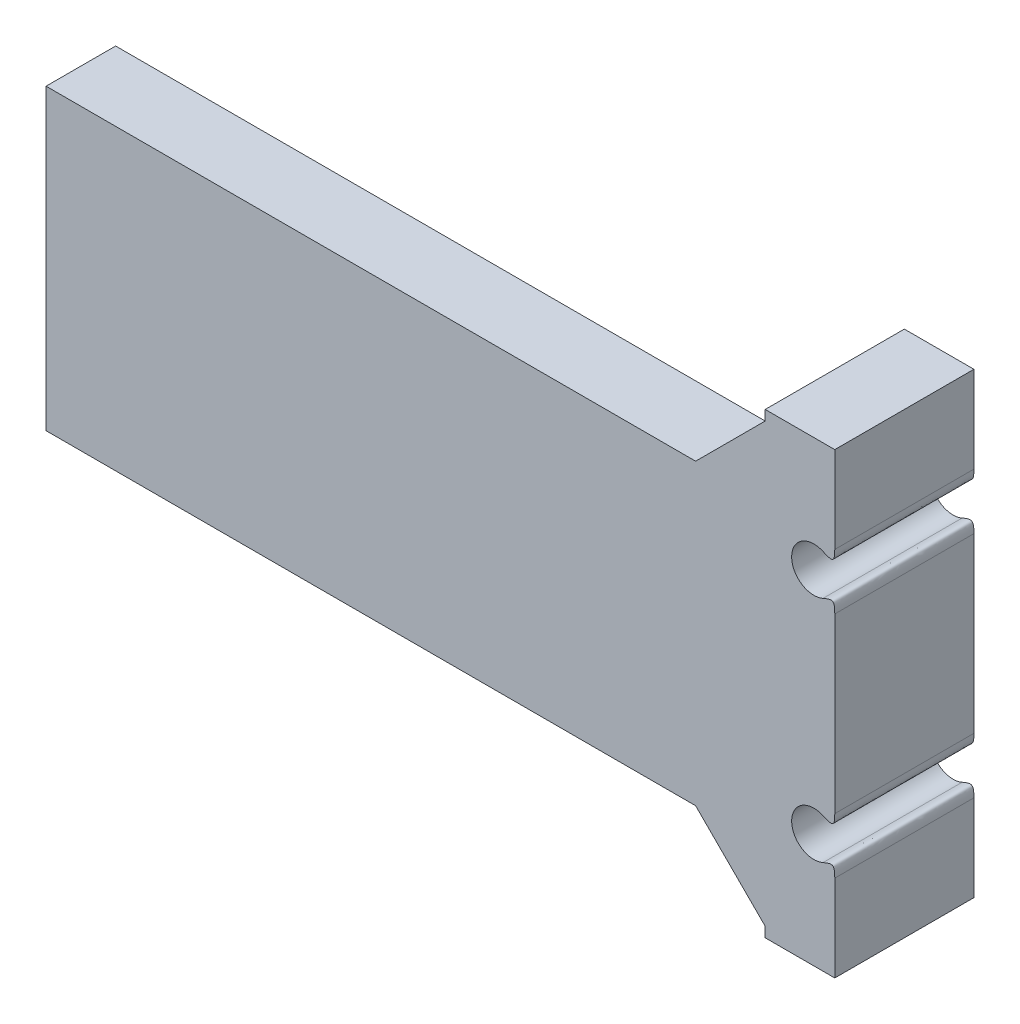
ISO-10303-21;
HEADER;
FILE_DESCRIPTION(('STEP AP214'),'2;1');
FILE_NAME('part.step','',(''),(''),'','','');
FILE_SCHEMA(('AUTOMOTIVE_DESIGN { 1 0 10303 214 1 1 1 1 }'));
ENDSEC;
DATA;
#1=APPLICATION_CONTEXT('core data for automotive mechanical design processes');
#2=APPLICATION_PROTOCOL_DEFINITION('international standard','automotive_design',2000,#1);
#3=PRODUCT_CONTEXT('',#1,'mechanical');
#4=PRODUCT('Part','Part','',(#3));
#5=PRODUCT_RELATED_PRODUCT_CATEGORY('part','',(#4));
#6=PRODUCT_DEFINITION_FORMATION('','',#4);
#7=PRODUCT_DEFINITION_CONTEXT('part definition',#1,'design');
#8=PRODUCT_DEFINITION('design','',#6,#7);
#9=PRODUCT_DEFINITION_SHAPE('','',#8);
#10=(LENGTH_UNIT() NAMED_UNIT(*) SI_UNIT(.MILLI.,.METRE.));
#11=(NAMED_UNIT(*) PLANE_ANGLE_UNIT() SI_UNIT($,.RADIAN.));
#12=(NAMED_UNIT(*) SI_UNIT($,.STERADIAN.) SOLID_ANGLE_UNIT());
#13=UNCERTAINTY_MEASURE_WITH_UNIT(LENGTH_MEASURE(1.E-05),#10,'distance_accuracy_value','');
#14=(GEOMETRIC_REPRESENTATION_CONTEXT(3) GLOBAL_UNCERTAINTY_ASSIGNED_CONTEXT((#13)) GLOBAL_UNIT_ASSIGNED_CONTEXT((#10,
#11,#12)) REPRESENTATION_CONTEXT('',''));
#15=CARTESIAN_POINT('',(0.,0.,0.));
#16=DIRECTION('',(0.,0.,1.));
#17=DIRECTION('',(1.,0.,0.));
#18=AXIS2_PLACEMENT_3D('',#15,#16,#17);
#19=CARTESIAN_POINT('',(-61.6780461379733,-1.56358606007839,-10.));
#20=DIRECTION('',(0.,-1.,0.));
#21=DIRECTION('',(1.,0.,0.));
#22=AXIS2_PLACEMENT_3D('',#19,#20,#21);
#23=PLANE('',#22);
#24=DIRECTION('',(0.,0.,1.));
#25=VECTOR('',#24,1.);
#26=CARTESIAN_POINT('',(-61.6780461379733,-1.56358606007839,-10.));
#27=LINE('',#26,#25);
#28=CARTESIAN_POINT('',(-61.6780461379733,-1.56358606007839,-5.));
#29=VERTEX_POINT('',#28);
#30=CARTESIAN_POINT('',(-61.6780461379733,-1.56358606007839,0.));
#31=VERTEX_POINT('',#30);
#32=EDGE_CURVE('E503',#29,#31,#27,.T.);
#33=ORIENTED_EDGE('',*,*,#32,.F.);
#34=DIRECTION('',(1.,0.,0.));
#35=VECTOR('',#34,1.);
#36=CARTESIAN_POINT('',(-61.6780461379733,-1.56358606007839,-5.));
#37=LINE('',#36,#35);
#38=CARTESIAN_POINT('',(-14.9999999999994,-1.56358606007837,-5.));
#39=VERTEX_POINT('',#38);
#40=EDGE_CURVE('E317',#29,#39,#37,.T.);
#41=ORIENTED_EDGE('',*,*,#40,.T.);
#42=DIRECTION('',(0.,0.,1.));
#43=VECTOR('',#42,1.);
#44=CARTESIAN_POINT('',(-14.9999999999994,-1.56358606007839,0.));
#45=LINE('',#44,#43);
#46=CARTESIAN_POINT('',(-14.9999999999994,-1.56358606007839,0.));
#47=VERTEX_POINT('',#46);
#48=EDGE_CURVE('E221',#39,#47,#45,.T.);
#49=ORIENTED_EDGE('',*,*,#48,.T.);
#50=DIRECTION('',(1.,0.,0.));
#51=VECTOR('',#50,1.);
#52=CARTESIAN_POINT('',(-61.6780461379733,-1.56358606007839,0.));
#53=LINE('',#52,#51);
#54=EDGE_CURVE('E323',#31,#47,#53,.T.);
#55=ORIENTED_EDGE('',*,*,#54,.F.);
#56=EDGE_LOOP('',(#33,#41,#49,#55));
#57=FACE_BOUND('',#56,.T.);
#58=ADVANCED_FACE('F46',(#57),#23,.T.);
#59=CARTESIAN_POINT('',(-61.6780461379733,19.8788046466407,-10.));
#60=DIRECTION('',(-1.,0.,0.));
#61=DIRECTION('',(0.,0.,1.));
#62=AXIS2_PLACEMENT_3D('',#59,#60,#61);
#63=PLANE('',#62);
#64=DIRECTION('',(0.,0.,1.));
#65=VECTOR('',#64,1.);
#66=CARTESIAN_POINT('',(-61.6780461379733,19.8788046466407,-10.));
#67=LINE('',#66,#65);
#68=CARTESIAN_POINT('',(-61.6780461379733,19.8788046466407,-5.));
#69=VERTEX_POINT('',#68);
#70=CARTESIAN_POINT('',(-61.6780461379733,19.8788046466407,0.));
#71=VERTEX_POINT('',#70);
#72=EDGE_CURVE('E313',#69,#71,#67,.T.);
#73=ORIENTED_EDGE('',*,*,#72,.F.);
#74=DIRECTION('',(0.,-1.,0.));
#75=VECTOR('',#74,1.);
#76=CARTESIAN_POINT('',(-61.6780461379733,30.7152185865621,-5.));
#77=LINE('',#76,#75);
#78=EDGE_CURVE('E629',#69,#29,#77,.T.);
#79=ORIENTED_EDGE('',*,*,#78,.T.);
#80=ORIENTED_EDGE('',*,*,#32,.T.);
#81=DIRECTION('',(0.,-1.,0.));
#82=VECTOR('',#81,1.);
#83=CARTESIAN_POINT('',(-61.6780461379733,19.8788046466407,0.));
#84=LINE('',#83,#82);
#85=EDGE_CURVE('E320',#71,#31,#84,.T.);
#86=ORIENTED_EDGE('',*,*,#85,.F.);
#87=EDGE_LOOP('',(#73,#79,#80,#86));
#88=FACE_BOUND('',#87,.T.);
#89=ADVANCED_FACE('F641',(#88),#63,.T.);
#90=CARTESIAN_POINT('',(-9.99999999999941,19.8788046466407,-10.));
#91=DIRECTION('',(0.,1.,0.));
#92=DIRECTION('',(0.,0.,1.));
#93=AXIS2_PLACEMENT_3D('',#90,#91,#92);
#94=PLANE('',#93);
#95=DIRECTION('',(0.,0.,-1.));
#96=VECTOR('',#95,1.);
#97=CARTESIAN_POINT('',(-14.9999999999994,19.8788046466407,-10.));
#98=LINE('',#97,#96);
#99=CARTESIAN_POINT('',(-14.9999999999994,19.8788046466407,0.));
#100=VERTEX_POINT('',#99);
#101=CARTESIAN_POINT('',(-14.9999999999994,19.8788046466407,-5.00000000000006));
#102=VERTEX_POINT('',#101);
#103=EDGE_CURVE('E215',#100,#102,#98,.T.);
#104=ORIENTED_EDGE('',*,*,#103,.T.);
#105=DIRECTION('',(-1.,0.,0.));
#106=VECTOR('',#105,1.);
#107=CARTESIAN_POINT('',(-9.99999999999941,19.8788046466407,-5.));
#108=LINE('',#107,#106);
#109=EDGE_CURVE('E191',#102,#69,#108,.T.);
#110=ORIENTED_EDGE('',*,*,#109,.T.);
#111=ORIENTED_EDGE('',*,*,#72,.T.);
#112=DIRECTION('',(-1.,0.,0.));
#113=VECTOR('',#112,1.);
#114=CARTESIAN_POINT('',(-9.99999999999941,19.8788046466407,0.));
#115=LINE('',#114,#113);
#116=EDGE_CURVE('E316',#100,#71,#115,.T.);
#117=ORIENTED_EDGE('',*,*,#116,.F.);
#118=EDGE_LOOP('',(#104,#110,#111,#117));
#119=FACE_BOUND('',#118,.T.);
#120=ADVANCED_FACE('F643',(#119),#94,.T.);
#121=CARTESIAN_POINT('',(-6.49999999999951,17.3788046466405,-10.));
#122=DIRECTION('',(0.,0.,1.));
#123=DIRECTION('',(1.,0.,0.));
#124=AXIS2_PLACEMENT_3D('',#121,#122,#123);
#125=PLANE('',#124);
#126=DIRECTION('',(0.,1.,0.));
#127=VECTOR('',#126,1.);
#128=CARTESIAN_POINT('',(-4.99999999999952,25.6000000000002,-10.));
#129=LINE('',#128,#127);
#130=CARTESIAN_POINT('',(-4.9999999999995,19.3862906366289,-10.));
#131=VERTEX_POINT('',#130);
#132=CARTESIAN_POINT('',(-4.99999999999952,25.6000000000002,-10.));
#133=VERTEX_POINT('',#132);
#134=EDGE_CURVE('E298',#131,#133,#129,.T.);
#135=ORIENTED_EDGE('',*,*,#134,.F.);
#136=CARTESIAN_POINT('',(-5.84545454545405,18.8387944575412,-10.));
#137=CARTESIAN_POINT('',(-4.9999999999995,18.4597586412496,-10.));
#138=CARTESIAN_POINT('',(-4.9999999999995,19.3862906366289,-10.));
#139=(BOUNDED_CURVE() B_SPLINE_CURVE(2,(#136,#137,#138),.UNSPECIFIED.,.F.,
.F.) B_SPLINE_CURVE_WITH_KNOTS((3,3),(0.,1.),
.UNSPECIFIED.) CURVE() GEOMETRIC_REPRESENTATION_ITEM() RATIONAL_B_SPLINE_CURVE((1.,
1.85714285714286,1.)) REPRESENTATION_ITEM(''));
#140=CARTESIAN_POINT('',(-5.84545454545405,18.8387944575412,-10.));
#141=VERTEX_POINT('',#140);
#142=EDGE_CURVE('E360',#131,#141,#139,.F.);
#143=ORIENTED_EDGE('',*,*,#142,.T.);
#144=CARTESIAN_POINT('',(-6.49999999999951,17.3788046466405,-10.));
#145=DIRECTION('',(0.,0.,-1.));
#146=DIRECTION('',(1.,0.,0.));
#147=AXIS2_PLACEMENT_3D('',#144,#145,#146);
#148=CIRCLE('',#147,1.6);
#149=CARTESIAN_POINT('',(-5.84545454545404,15.9188148357398,-10.));
#150=VERTEX_POINT('',#149);
#151=EDGE_CURVE('E236',#150,#141,#148,.T.);
#152=ORIENTED_EDGE('',*,*,#151,.F.);
#153=CARTESIAN_POINT('',(-4.99999999999949,15.371318656652,-10.));
#154=CARTESIAN_POINT('',(-4.99999999999949,16.2978506520313,-10.));
#155=CARTESIAN_POINT('',(-5.84545454545404,15.9188148357398,-10.));
#156=(BOUNDED_CURVE() B_SPLINE_CURVE(2,(#153,#154,#155),.UNSPECIFIED.,.F.,
.F.) B_SPLINE_CURVE_WITH_KNOTS((3,3),(0.,1.),
.UNSPECIFIED.) CURVE() GEOMETRIC_REPRESENTATION_ITEM() RATIONAL_B_SPLINE_CURVE((1.,
1.85714285714286,1.)) REPRESENTATION_ITEM(''));
#157=CARTESIAN_POINT('',(-4.99999999999949,15.371318656652,-10.));
#158=VERTEX_POINT('',#157);
#159=EDGE_CURVE('E440',#150,#158,#156,.F.);
#160=ORIENTED_EDGE('',*,*,#159,.T.);
#161=DIRECTION('',(0.,1.,0.));
#162=VECTOR('',#161,1.);
#163=CARTESIAN_POINT('',(-4.99999999999949,16.8220282103575,-10.));
#164=LINE('',#163,#162);
#165=CARTESIAN_POINT('',(-4.99999999999944,2.94389992990988,-10.));
#166=VERTEX_POINT('',#165);
#167=EDGE_CURVE('E460',#166,#158,#164,.T.);
#168=ORIENTED_EDGE('',*,*,#167,.F.);
#169=CARTESIAN_POINT('',(-5.84545454545399,2.39640375082211,-10.));
#170=CARTESIAN_POINT('',(-4.99999999999944,2.01736793453057,-10.));
#171=CARTESIAN_POINT('',(-4.99999999999945,2.94389992990988,-10.));
#172=(BOUNDED_CURVE() B_SPLINE_CURVE(2,(#169,#170,#171),.UNSPECIFIED.,.F.,
.F.) B_SPLINE_CURVE_WITH_KNOTS((3,3),(0.,1.),
.UNSPECIFIED.) CURVE() GEOMETRIC_REPRESENTATION_ITEM() RATIONAL_B_SPLINE_CURVE((1.,
1.85714285714286,1.)) REPRESENTATION_ITEM(''));
#173=CARTESIAN_POINT('',(-5.84545454545399,2.39640375082211,-10.));
#174=VERTEX_POINT('',#173);
#175=EDGE_CURVE('E74',#166,#174,#172,.F.);
#176=ORIENTED_EDGE('',*,*,#175,.T.);
#177=CARTESIAN_POINT('',(-6.49999999999945,0.936413939921402,-10.));
#178=DIRECTION('',(0.,0.,-1.));
#179=DIRECTION('',(1.,0.,0.));
#180=AXIS2_PLACEMENT_3D('',#177,#178,#179);
#181=CIRCLE('',#180,1.6);
#182=CARTESIAN_POINT('',(-5.84545454545398,-0.523575870979301,-10.));
#183=VERTEX_POINT('',#182);
#184=EDGE_CURVE('E614',#183,#174,#181,.T.);
#185=ORIENTED_EDGE('',*,*,#184,.F.);
#186=CARTESIAN_POINT('',(-4.99999999999943,-1.07107205006706,-10.));
#187=CARTESIAN_POINT('',(-4.99999999999943,-0.144540054687758,-10.));
#188=CARTESIAN_POINT('',(-5.84545454545398,-0.523575870979301,-10.));
#189=(BOUNDED_CURVE() B_SPLINE_CURVE(2,(#186,#187,#188),.UNSPECIFIED.,.F.,
.F.) B_SPLINE_CURVE_WITH_KNOTS((3,3),(0.,1.),
.UNSPECIFIED.) CURVE() GEOMETRIC_REPRESENTATION_ITEM() RATIONAL_B_SPLINE_CURVE((1.,
1.85714285714286,1.)) REPRESENTATION_ITEM(''));
#190=CARTESIAN_POINT('',(-4.99999999999943,-1.07107205006706,-10.));
#191=VERTEX_POINT('',#190);
#192=EDGE_CURVE('E67',#183,#191,#189,.F.);
#193=ORIENTED_EDGE('',*,*,#192,.T.);
#194=DIRECTION('',(0.,1.,0.));
#195=VECTOR('',#194,1.);
#196=CARTESIAN_POINT('',(-4.99999999999944,0.379637503638441,-10.));
#197=LINE('',#196,#195);
#198=CARTESIAN_POINT('',(-4.99999999999941,-7.28478141343791,-10.));
#199=VERTEX_POINT('',#198);
#200=EDGE_CURVE('E486',#199,#191,#197,.T.);
#201=ORIENTED_EDGE('',*,*,#200,.F.);
#202=DIRECTION('',(1.,0.,0.));
#203=VECTOR('',#202,1.);
#204=CARTESIAN_POINT('',(-4.99999999999941,-7.28478141343791,-10.));
#205=LINE('',#204,#203);
#206=CARTESIAN_POINT('',(-9.99999999999941,-7.28478141343791,-10.));
#207=VERTEX_POINT('',#206);
#208=EDGE_CURVE('E498',#207,#199,#205,.T.);
#209=ORIENTED_EDGE('',*,*,#208,.F.);
#210=DIRECTION('',(0.,-1.,0.));
#211=VECTOR('',#210,1.);
#212=CARTESIAN_POINT('',(-9.99999999999941,-7.28478141343791,-10.));
#213=LINE('',#212,#211);
#214=CARTESIAN_POINT('',(-9.99999999999941,-6.56358606007836,-10.));
#215=VERTEX_POINT('',#214);
#216=EDGE_CURVE('E203',#215,#207,#213,.T.);
#217=ORIENTED_EDGE('',*,*,#216,.F.);
#218=DIRECTION('',(0.,-1.,0.));
#219=VECTOR('',#218,1.);
#220=CARTESIAN_POINT('',(-9.99999999999942,30.7152185865621,-10.));
#221=LINE('',#220,#219);
#222=CARTESIAN_POINT('',(-9.99999999999941,24.8788046466407,-10.));
#223=VERTEX_POINT('',#222);
#224=EDGE_CURVE('E182',#223,#215,#221,.T.);
#225=ORIENTED_EDGE('',*,*,#224,.F.);
#226=DIRECTION('',(0.,-1.,0.));
#227=VECTOR('',#226,1.);
#228=CARTESIAN_POINT('',(-9.99999999999941,19.8788046466407,-10.));
#229=LINE('',#228,#227);
#230=CARTESIAN_POINT('',(-9.99999999999941,25.6000000000002,-10.));
#231=VERTEX_POINT('',#230);
#232=EDGE_CURVE('E200',#231,#223,#229,.T.);
#233=ORIENTED_EDGE('',*,*,#232,.F.);
#234=DIRECTION('',(-1.,0.,0.));
#235=VECTOR('',#234,1.);
#236=CARTESIAN_POINT('',(-9.99999999999941,25.6000000000002,-10.));
#237=LINE('',#236,#235);
#238=EDGE_CURVE('E306',#133,#231,#237,.T.);
#239=ORIENTED_EDGE('',*,*,#238,.F.);
#240=EDGE_LOOP('',(#135,#143,#152,#160,#168,#176,#185,#193,#201,#209,#217,#225,#233,#239));
#241=FACE_BOUND('',#240,.T.);
#242=ADVANCED_FACE('F198',(#241),#125,.F.);
#243=CARTESIAN_POINT('',(-14.9999999999994,-1.56358606007839,-10.));
#244=DIRECTION('',(-0.707106781186544,-0.707106781186551,0.));
#245=DIRECTION('',(0.,0.,-1.));
#246=AXIS2_PLACEMENT_3D('',#243,#244,#245);
#247=PLANE('',#246);
#248=DIRECTION('',(0.577350269189629,-0.577350269189623,-0.577350269189626));
#249=VECTOR('',#248,1.);
#250=CARTESIAN_POINT('',(-13.3333333333328,-3.23025272674505,-6.66666666666667));
#251=LINE('',#250,#249);
#252=EDGE_CURVE('E627',#215,#39,#251,.F.);
#253=ORIENTED_EDGE('',*,*,#252,.F.);
#254=DIRECTION('',(0.,0.,-1.));
#255=VECTOR('',#254,1.);
#256=CARTESIAN_POINT('',(-9.99999999999941,-6.56358606007837,-10.));
#257=LINE('',#256,#255);
#258=CARTESIAN_POINT('',(-9.99999999999941,-6.56358606007837,0.));
#259=VERTEX_POINT('',#258);
#260=EDGE_CURVE('E216',#259,#215,#257,.T.);
#261=ORIENTED_EDGE('',*,*,#260,.F.);
#262=DIRECTION('',(-0.707106781186551,0.707106781186544,0.));
#263=VECTOR('',#262,1.);
#264=CARTESIAN_POINT('',(-14.9999999999994,-1.56358606007839,0.));
#265=LINE('',#264,#263);
#266=EDGE_CURVE('E218',#47,#259,#265,.F.);
#267=ORIENTED_EDGE('',*,*,#266,.F.);
#268=ORIENTED_EDGE('',*,*,#48,.F.);
#269=EDGE_LOOP('',(#253,#261,#267,#268));
#270=FACE_BOUND('',#269,.T.);
#271=ADVANCED_FACE('F635',(#270),#247,.T.);
#272=CARTESIAN_POINT('',(-9.99999999999941,24.8788046466408,-10.));
#273=DIRECTION('',(-0.707106781186551,0.707106781186544,0.));
#274=DIRECTION('',(0.,0.,-1.));
#275=AXIS2_PLACEMENT_3D('',#272,#273,#274);
#276=PLANE('',#275);
#277=DIRECTION('',(-0.577350269189625,-0.577350269189631,0.577350269189622));
#278=VECTOR('',#277,1.);
#279=CARTESIAN_POINT('',(-9.99999999999941,24.8788046466407,-10.));
#280=LINE('',#279,#278);
#281=EDGE_CURVE('E179',#102,#223,#280,.F.);
#282=ORIENTED_EDGE('',*,*,#281,.F.);
#283=ORIENTED_EDGE('',*,*,#103,.F.);
#284=DIRECTION('',(0.707106781186544,0.707106781186551,0.));
#285=VECTOR('',#284,1.);
#286=CARTESIAN_POINT('',(-9.99999999999941,24.8788046466408,0.));
#287=LINE('',#286,#285);
#288=CARTESIAN_POINT('',(-9.99999999999941,24.8788046466408,0.));
#289=VERTEX_POINT('',#288);
#290=EDGE_CURVE('E192',#289,#100,#287,.F.);
#291=ORIENTED_EDGE('',*,*,#290,.F.);
#292=DIRECTION('',(0.,0.,1.));
#293=VECTOR('',#292,1.);
#294=CARTESIAN_POINT('',(-9.99999999999941,24.8788046466408,0.));
#295=LINE('',#294,#293);
#296=EDGE_CURVE('E209',#223,#289,#295,.T.);
#297=ORIENTED_EDGE('',*,*,#296,.F.);
#298=EDGE_LOOP('',(#282,#283,#291,#297));
#299=FACE_BOUND('',#298,.T.);
#300=ADVANCED_FACE('F214',(#299),#276,.T.);
#301=CARTESIAN_POINT('',(-9.99999999999941,19.8788046466407,-10.));
#302=DIRECTION('',(-1.,0.,0.));
#303=DIRECTION('',(0.,0.,1.));
#304=AXIS2_PLACEMENT_3D('',#301,#302,#303);
#305=PLANE('',#304);
#306=ORIENTED_EDGE('',*,*,#232,.T.);
#307=ORIENTED_EDGE('',*,*,#296,.T.);
#308=DIRECTION('',(0.,-1.,0.));
#309=VECTOR('',#308,1.);
#310=CARTESIAN_POINT('',(-9.99999999999941,19.8788046466407,0.));
#311=LINE('',#310,#309);
#312=CARTESIAN_POINT('',(-9.99999999999941,25.6000000000002,0.));
#313=VERTEX_POINT('',#312);
#314=EDGE_CURVE('E314',#313,#289,#311,.T.);
#315=ORIENTED_EDGE('',*,*,#314,.F.);
#316=DIRECTION('',(0.,0.,1.));
#317=VECTOR('',#316,1.);
#318=CARTESIAN_POINT('',(-9.99999999999941,25.6000000000002,-10.));
#319=LINE('',#318,#317);
#320=EDGE_CURVE('E211',#231,#313,#319,.T.);
#321=ORIENTED_EDGE('',*,*,#320,.F.);
#322=EDGE_LOOP('',(#306,#307,#315,#321));
#323=FACE_BOUND('',#322,.T.);
#324=ADVANCED_FACE('F207',(#323),#305,.T.);
#325=CARTESIAN_POINT('',(-9.99999999999941,25.6000000000002,-10.));
#326=DIRECTION('',(0.,1.,0.));
#327=DIRECTION('',(0.,0.,1.));
#328=AXIS2_PLACEMENT_3D('',#325,#326,#327);
#329=PLANE('',#328);
#330=DIRECTION('',(-1.,0.,0.));
#331=VECTOR('',#330,1.);
#332=CARTESIAN_POINT('',(-9.99999999999941,25.6000000000002,0.));
#333=LINE('',#332,#331);
#334=CARTESIAN_POINT('',(-4.99999999999952,25.6000000000002,0.));
#335=VERTEX_POINT('',#334);
#336=EDGE_CURVE('E212',#335,#313,#333,.T.);
#337=ORIENTED_EDGE('',*,*,#336,.F.);
#338=DIRECTION('',(0.,0.,1.));
#339=VECTOR('',#338,1.);
#340=CARTESIAN_POINT('',(-4.99999999999952,25.6000000000002,-10.));
#341=LINE('',#340,#339);
#342=EDGE_CURVE('E499',#133,#335,#341,.T.);
#343=ORIENTED_EDGE('',*,*,#342,.F.);
#344=ORIENTED_EDGE('',*,*,#238,.T.);
#345=ORIENTED_EDGE('',*,*,#320,.T.);
#346=EDGE_LOOP('',(#337,#343,#344,#345));
#347=FACE_BOUND('',#346,.T.);
#348=ADVANCED_FACE('F275',(#347),#329,.T.);
#349=CARTESIAN_POINT('',(-4.99999999999952,25.6000000000002,-10.));
#350=DIRECTION('',(1.,0.,0.));
#351=DIRECTION('',(0.,1.,0.));
#352=AXIS2_PLACEMENT_3D('',#349,#350,#351);
#353=PLANE('',#352);
#354=DIRECTION('',(0.,1.,0.));
#355=VECTOR('',#354,1.);
#356=CARTESIAN_POINT('',(-4.99999999999952,25.6000000000002,0.));
#357=LINE('',#356,#355);
#358=CARTESIAN_POINT('',(-4.9999999999995,19.3862906366289,0.));
#359=VERTEX_POINT('',#358);
#360=EDGE_CURVE('E234',#359,#335,#357,.T.);
#361=ORIENTED_EDGE('',*,*,#360,.F.);
#362=CARTESIAN_POINT('',(-4.9999999999995,19.3862906366289,-10.5));
#363=CARTESIAN_POINT('',(-4.9999999999995,19.3862906366289,-6.83333333333332));
#364=CARTESIAN_POINT('',(-4.9999999999995,19.3862906366289,-3.16666666666667));
#365=CARTESIAN_POINT('',(-4.9999999999995,19.3862906366289,0.5));
#366=(BOUNDED_CURVE() B_SPLINE_CURVE(3,(#362,#363,#364,#365),.UNSPECIFIED.,.F.,
.F.) B_SPLINE_CURVE_WITH_KNOTS((4,4),(-0.0005,0.0105),
.UNSPECIFIED.) CURVE() GEOMETRIC_REPRESENTATION_ITEM() RATIONAL_B_SPLINE_CURVE((1.,1.,1.,1.)) REPRESENTATION_ITEM(''));
#367=EDGE_CURVE('E441',#359,#131,#366,.F.);
#368=ORIENTED_EDGE('',*,*,#367,.T.);
#369=ORIENTED_EDGE('',*,*,#134,.T.);
#370=ORIENTED_EDGE('',*,*,#342,.T.);
#371=EDGE_LOOP('',(#361,#368,#369,#370));
#372=FACE_BOUND('',#371,.T.);
#373=ADVANCED_FACE('F516',(#372),#353,.T.);
#374=CARTESIAN_POINT('',(-6.49999999999951,17.3788046466405,-10.));
#375=DIRECTION('',(0.,0.,1.));
#376=DIRECTION('',(1.,0.,0.));
#377=AXIS2_PLACEMENT_3D('',#374,#375,#376);
#378=CYLINDRICAL_SURFACE('',#377,1.6);
#379=ORIENTED_EDGE('',*,*,#151,.T.);
#380=CARTESIAN_POINT('',(-5.84545454545405,18.8387944575412,0.5));
#381=CARTESIAN_POINT('',(-5.84545454545405,18.8387944575412,-3.16666666666667));
#382=CARTESIAN_POINT('',(-5.84545454545405,18.8387944575412,-6.83333333333332));
#383=CARTESIAN_POINT('',(-5.84545454545405,18.8387944575412,-10.5));
#384=(BOUNDED_CURVE() B_SPLINE_CURVE(3,(#380,#381,#382,#383),.UNSPECIFIED.,.F.,
.F.) B_SPLINE_CURVE_WITH_KNOTS((4,4),(-0.0005,0.0105),
.UNSPECIFIED.) CURVE() GEOMETRIC_REPRESENTATION_ITEM() RATIONAL_B_SPLINE_CURVE((1.,1.,1.,1.)) REPRESENTATION_ITEM(''));
#385=CARTESIAN_POINT('',(-5.84545454545405,18.8387944575412,0.));
#386=VERTEX_POINT('',#385);
#387=EDGE_CURVE('E445',#141,#386,#384,.F.);
#388=ORIENTED_EDGE('',*,*,#387,.T.);
#389=CARTESIAN_POINT('',(-6.49999999999951,17.3788046466405,0.));
#390=DIRECTION('',(0.,0.,-1.));
#391=DIRECTION('',(1.,0.,0.));
#392=AXIS2_PLACEMENT_3D('',#389,#390,#391);
#393=CIRCLE('',#392,1.6);
#394=CARTESIAN_POINT('',(-5.84545454545404,15.9188148357398,0.));
#395=VERTEX_POINT('',#394);
#396=EDGE_CURVE('E230',#395,#386,#393,.T.);
#397=ORIENTED_EDGE('',*,*,#396,.F.);
#398=CARTESIAN_POINT('',(-5.84545454545404,15.9188148357398,-10.5));
#399=CARTESIAN_POINT('',(-5.84545454545404,15.9188148357398,-6.83333333333332));
#400=CARTESIAN_POINT('',(-5.84545454545404,15.9188148357398,-3.16666666666667));
#401=CARTESIAN_POINT('',(-5.84545454545404,15.9188148357398,0.5));
#402=(BOUNDED_CURVE() B_SPLINE_CURVE(3,(#398,#399,#400,#401),.UNSPECIFIED.,.F.,
.F.) B_SPLINE_CURVE_WITH_KNOTS((4,4),(-0.0005,0.0105),
.UNSPECIFIED.) CURVE() GEOMETRIC_REPRESENTATION_ITEM() RATIONAL_B_SPLINE_CURVE((1.,1.,1.,1.)) REPRESENTATION_ITEM(''));
#403=EDGE_CURVE('E229',#395,#150,#402,.F.);
#404=ORIENTED_EDGE('',*,*,#403,.T.);
#405=EDGE_LOOP('',(#379,#388,#397,#404));
#406=FACE_BOUND('',#405,.T.);
#407=ADVANCED_FACE('F452',(#406),#378,.F.);
#408=CARTESIAN_POINT('',(-4.99999999999949,16.8220282103575,-10.));
#409=DIRECTION('',(1.,0.,0.));
#410=DIRECTION('',(0.,1.,0.));
#411=AXIS2_PLACEMENT_3D('',#408,#409,#410);
#412=PLANE('',#411);
#413=ORIENTED_EDGE('',*,*,#167,.T.);
#414=CARTESIAN_POINT('',(-4.99999999999949,15.371318656652,0.5));
#415=CARTESIAN_POINT('',(-4.99999999999949,15.371318656652,-3.16666666666667));
#416=CARTESIAN_POINT('',(-4.99999999999949,15.371318656652,-6.83333333333332));
#417=CARTESIAN_POINT('',(-4.99999999999949,15.371318656652,-10.5));
#418=(BOUNDED_CURVE() B_SPLINE_CURVE(3,(#414,#415,#416,#417),.UNSPECIFIED.,.F.,
.F.) B_SPLINE_CURVE_WITH_KNOTS((4,4),(-0.0005,0.0105),
.UNSPECIFIED.) CURVE() GEOMETRIC_REPRESENTATION_ITEM() RATIONAL_B_SPLINE_CURVE((1.,1.,1.,1.)) REPRESENTATION_ITEM(''));
#419=CARTESIAN_POINT('',(-4.99999999999949,15.371318656652,0.));
#420=VERTEX_POINT('',#419);
#421=EDGE_CURVE('E353',#158,#420,#418,.F.);
#422=ORIENTED_EDGE('',*,*,#421,.T.);
#423=DIRECTION('',(0.,1.,0.));
#424=VECTOR('',#423,1.);
#425=CARTESIAN_POINT('',(-4.99999999999949,16.8220282103575,0.));
#426=LINE('',#425,#424);
#427=CARTESIAN_POINT('',(-4.99999999999944,2.94389992990988,0.));
#428=VERTEX_POINT('',#427);
#429=EDGE_CURVE('E235',#428,#420,#426,.T.);
#430=ORIENTED_EDGE('',*,*,#429,.F.);
#431=CARTESIAN_POINT('',(-4.99999999999944,2.94389992990988,-10.5));
#432=CARTESIAN_POINT('',(-4.99999999999944,2.94389992990988,-6.83333333333332));
#433=CARTESIAN_POINT('',(-4.99999999999944,2.94389992990988,-3.16666666666667));
#434=CARTESIAN_POINT('',(-4.99999999999944,2.94389992990988,0.5));
#435=(BOUNDED_CURVE() B_SPLINE_CURVE(3,(#431,#432,#433,#434),.UNSPECIFIED.,.F.,
.F.) B_SPLINE_CURVE_WITH_KNOTS((4,4),(-0.0005,0.0105),
.UNSPECIFIED.) CURVE() GEOMETRIC_REPRESENTATION_ITEM() RATIONAL_B_SPLINE_CURVE((1.,1.,1.,1.)) REPRESENTATION_ITEM(''));
#436=EDGE_CURVE('E350',#428,#166,#435,.F.);
#437=ORIENTED_EDGE('',*,*,#436,.T.);
#438=EDGE_LOOP('',(#413,#422,#430,#437));
#439=FACE_BOUND('',#438,.T.);
#440=ADVANCED_FACE('F349',(#439),#412,.T.);
#441=CARTESIAN_POINT('',(-6.49999999999945,0.936413939921402,-10.));
#442=DIRECTION('',(0.,0.,1.));
#443=DIRECTION('',(1.,0.,0.));
#444=AXIS2_PLACEMENT_3D('',#441,#442,#443);
#445=CYLINDRICAL_SURFACE('',#444,1.6);
#446=CARTESIAN_POINT('',(-6.49999999999945,0.936413939921402,0.));
#447=DIRECTION('',(0.,0.,-1.));
#448=DIRECTION('',(1.,0.,0.));
#449=AXIS2_PLACEMENT_3D('',#446,#447,#448);
#450=CIRCLE('',#449,1.6);
#451=CARTESIAN_POINT('',(-5.84545454545398,-0.523575870979301,0.));
#452=VERTEX_POINT('',#451);
#453=CARTESIAN_POINT('',(-5.84545454545399,2.39640375082211,0.));
#454=VERTEX_POINT('',#453);
#455=EDGE_CURVE('E337',#452,#454,#450,.T.);
#456=ORIENTED_EDGE('',*,*,#455,.F.);
#457=CARTESIAN_POINT('',(-5.84545454545398,-0.523575870979301,-10.5));
#458=CARTESIAN_POINT('',(-5.84545454545398,-0.523575870979301,-6.83333333333332));
#459=CARTESIAN_POINT('',(-5.84545454545398,-0.523575870979301,-3.16666666666667));
#460=CARTESIAN_POINT('',(-5.84545454545398,-0.523575870979301,0.5));
#461=(BOUNDED_CURVE() B_SPLINE_CURVE(3,(#457,#458,#459,#460),.UNSPECIFIED.,.F.,
.F.) B_SPLINE_CURVE_WITH_KNOTS((4,4),(-0.0005,0.0105),
.UNSPECIFIED.) CURVE() GEOMETRIC_REPRESENTATION_ITEM() RATIONAL_B_SPLINE_CURVE((1.,1.,1.,1.)) REPRESENTATION_ITEM(''));
#462=EDGE_CURVE('E12',#452,#183,#461,.F.);
#463=ORIENTED_EDGE('',*,*,#462,.T.);
#464=ORIENTED_EDGE('',*,*,#184,.T.);
#465=CARTESIAN_POINT('',(-5.84545454545399,2.39640375082211,0.5));
#466=CARTESIAN_POINT('',(-5.84545454545399,2.39640375082211,-3.16666666666667));
#467=CARTESIAN_POINT('',(-5.84545454545399,2.39640375082211,-6.83333333333332));
#468=CARTESIAN_POINT('',(-5.84545454545399,2.39640375082211,-10.5));
#469=(BOUNDED_CURVE() B_SPLINE_CURVE(3,(#465,#466,#467,#468),.UNSPECIFIED.,.F.,
.F.) B_SPLINE_CURVE_WITH_KNOTS((4,4),(-0.0005,0.0105),
.UNSPECIFIED.) CURVE() GEOMETRIC_REPRESENTATION_ITEM() RATIONAL_B_SPLINE_CURVE((1.,1.,1.,1.)) REPRESENTATION_ITEM(''));
#470=EDGE_CURVE('E60',#174,#454,#469,.F.);
#471=ORIENTED_EDGE('',*,*,#470,.T.);
#472=EDGE_LOOP('',(#456,#463,#464,#471));
#473=FACE_BOUND('',#472,.T.);
#474=ADVANCED_FACE('F584',(#473),#445,.F.);
#475=CARTESIAN_POINT('',(-4.99999999999944,0.379637503638441,-10.));
#476=DIRECTION('',(1.,0.,0.));
#477=DIRECTION('',(0.,1.,0.));
#478=AXIS2_PLACEMENT_3D('',#475,#476,#477);
#479=PLANE('',#478);
#480=ORIENTED_EDGE('',*,*,#200,.T.);
#481=CARTESIAN_POINT('',(-4.99999999999943,-1.07107205006706,0.5));
#482=CARTESIAN_POINT('',(-4.99999999999943,-1.07107205006706,-3.16666666666667));
#483=CARTESIAN_POINT('',(-4.99999999999943,-1.07107205006706,-6.83333333333332));
#484=CARTESIAN_POINT('',(-4.99999999999943,-1.07107205006706,-10.5));
#485=(BOUNDED_CURVE() B_SPLINE_CURVE(3,(#481,#482,#483,#484),.UNSPECIFIED.,.F.,
.F.) B_SPLINE_CURVE_WITH_KNOTS((4,4),(-0.0005,0.0105),
.UNSPECIFIED.) CURVE() GEOMETRIC_REPRESENTATION_ITEM() RATIONAL_B_SPLINE_CURVE((1.,1.,1.,1.)) REPRESENTATION_ITEM(''));
#486=CARTESIAN_POINT('',(-4.99999999999943,-1.07107205006706,0.));
#487=VERTEX_POINT('',#486);
#488=EDGE_CURVE('E439',#191,#487,#485,.F.);
#489=ORIENTED_EDGE('',*,*,#488,.T.);
#490=DIRECTION('',(0.,1.,0.));
#491=VECTOR('',#490,1.);
#492=CARTESIAN_POINT('',(-4.99999999999944,0.379637503638441,0.));
#493=LINE('',#492,#491);
#494=CARTESIAN_POINT('',(-4.99999999999941,-7.28478141343791,0.));
#495=VERTEX_POINT('',#494);
#496=EDGE_CURVE('E331',#495,#487,#493,.T.);
#497=ORIENTED_EDGE('',*,*,#496,.F.);
#498=DIRECTION('',(0.,0.,1.));
#499=VECTOR('',#498,1.);
#500=CARTESIAN_POINT('',(-4.99999999999941,-7.28478141343791,-10.));
#501=LINE('',#500,#499);
#502=EDGE_CURVE('E497',#199,#495,#501,.T.);
#503=ORIENTED_EDGE('',*,*,#502,.F.);
#504=EDGE_LOOP('',(#480,#489,#497,#503));
#505=FACE_BOUND('',#504,.T.);
#506=ADVANCED_FACE('F485',(#505),#479,.T.);
#507=CARTESIAN_POINT('',(-4.99999999999941,-7.28478141343791,-10.));
#508=DIRECTION('',(0.,-1.,0.));
#509=DIRECTION('',(1.,0.,0.));
#510=AXIS2_PLACEMENT_3D('',#507,#508,#509);
#511=PLANE('',#510);
#512=DIRECTION('',(1.,0.,0.));
#513=VECTOR('',#512,1.);
#514=CARTESIAN_POINT('',(-4.99999999999941,-7.28478141343791,0.));
#515=LINE('',#514,#513);
#516=CARTESIAN_POINT('',(-9.99999999999941,-7.28478141343791,0.));
#517=VERTEX_POINT('',#516);
#518=EDGE_CURVE('E328',#517,#495,#515,.T.);
#519=ORIENTED_EDGE('',*,*,#518,.F.);
#520=DIRECTION('',(0.,0.,1.));
#521=VECTOR('',#520,1.);
#522=CARTESIAN_POINT('',(-9.99999999999941,-7.28478141343791,-10.));
#523=LINE('',#522,#521);
#524=EDGE_CURVE('E496',#207,#517,#523,.T.);
#525=ORIENTED_EDGE('',*,*,#524,.F.);
#526=ORIENTED_EDGE('',*,*,#208,.T.);
#527=ORIENTED_EDGE('',*,*,#502,.T.);
#528=EDGE_LOOP('',(#519,#525,#526,#527));
#529=FACE_BOUND('',#528,.T.);
#530=ADVANCED_FACE('F494',(#529),#511,.T.);
#531=CARTESIAN_POINT('',(-9.99999999999941,-7.28478141343791,-10.));
#532=DIRECTION('',(-1.,0.,0.));
#533=DIRECTION('',(0.,0.,1.));
#534=AXIS2_PLACEMENT_3D('',#531,#532,#533);
#535=PLANE('',#534);
#536=DIRECTION('',(0.,-1.,0.));
#537=VECTOR('',#536,1.);
#538=CARTESIAN_POINT('',(-9.99999999999941,-7.28478141343791,0.));
#539=LINE('',#538,#537);
#540=EDGE_CURVE('E326',#259,#517,#539,.T.);
#541=ORIENTED_EDGE('',*,*,#540,.F.);
#542=ORIENTED_EDGE('',*,*,#260,.T.);
#543=ORIENTED_EDGE('',*,*,#216,.T.);
#544=ORIENTED_EDGE('',*,*,#524,.T.);
#545=EDGE_LOOP('',(#541,#542,#543,#544));
#546=FACE_BOUND('',#545,.T.);
#547=ADVANCED_FACE('F272',(#546),#535,.T.);
#548=CARTESIAN_POINT('',(-6.49999999999951,17.3788046466405,0.));
#549=DIRECTION('',(0.,0.,1.));
#550=DIRECTION('',(1.,0.,0.));
#551=AXIS2_PLACEMENT_3D('',#548,#549,#550);
#552=PLANE('',#551);
#553=ORIENTED_EDGE('',*,*,#396,.T.);
#554=CARTESIAN_POINT('',(-4.9999999999995,19.3862906366289,0.));
#555=CARTESIAN_POINT('',(-4.99999999999949,18.4597586412496,0.));
#556=CARTESIAN_POINT('',(-5.84545454545405,18.8387944575412,0.));
#557=(BOUNDED_CURVE() B_SPLINE_CURVE(2,(#554,#555,#556),.UNSPECIFIED.,.F.,
.F.) B_SPLINE_CURVE_WITH_KNOTS((3,3),(0.,1.),
.UNSPECIFIED.) CURVE() GEOMETRIC_REPRESENTATION_ITEM() RATIONAL_B_SPLINE_CURVE((1.,
1.85714285714286,1.)) REPRESENTATION_ITEM(''));
#558=EDGE_CURVE('E293',#386,#359,#557,.F.);
#559=ORIENTED_EDGE('',*,*,#558,.T.);
#560=ORIENTED_EDGE('',*,*,#360,.T.);
#561=ORIENTED_EDGE('',*,*,#336,.T.);
#562=ORIENTED_EDGE('',*,*,#314,.T.);
#563=ORIENTED_EDGE('',*,*,#290,.T.);
#564=ORIENTED_EDGE('',*,*,#116,.T.);
#565=ORIENTED_EDGE('',*,*,#85,.T.);
#566=ORIENTED_EDGE('',*,*,#54,.T.);
#567=ORIENTED_EDGE('',*,*,#266,.T.);
#568=ORIENTED_EDGE('',*,*,#540,.T.);
#569=ORIENTED_EDGE('',*,*,#518,.T.);
#570=ORIENTED_EDGE('',*,*,#496,.T.);
#571=CARTESIAN_POINT('',(-5.84545454545398,-0.523575870979301,0.));
#572=CARTESIAN_POINT('',(-4.99999999999943,-0.144540054687758,0.));
#573=CARTESIAN_POINT('',(-4.99999999999943,-1.07107205006706,0.));
#574=(BOUNDED_CURVE() B_SPLINE_CURVE(2,(#571,#572,#573),.UNSPECIFIED.,.F.,
.F.) B_SPLINE_CURVE_WITH_KNOTS((3,3),(0.,1.),
.UNSPECIFIED.) CURVE() GEOMETRIC_REPRESENTATION_ITEM() RATIONAL_B_SPLINE_CURVE((1.,
1.85714285714286,1.)) REPRESENTATION_ITEM(''));
#575=EDGE_CURVE('E444',#487,#452,#574,.F.);
#576=ORIENTED_EDGE('',*,*,#575,.T.);
#577=ORIENTED_EDGE('',*,*,#455,.T.);
#578=CARTESIAN_POINT('',(-4.99999999999944,2.94389992990988,0.));
#579=CARTESIAN_POINT('',(-4.99999999999944,2.01736793453057,0.));
#580=CARTESIAN_POINT('',(-5.84545454545399,2.39640375082211,0.));
#581=(BOUNDED_CURVE() B_SPLINE_CURVE(2,(#578,#579,#580),.UNSPECIFIED.,.F.,
.F.) B_SPLINE_CURVE_WITH_KNOTS((3,3),(0.,1.),
.UNSPECIFIED.) CURVE() GEOMETRIC_REPRESENTATION_ITEM() RATIONAL_B_SPLINE_CURVE((1.,
1.85714285714286,1.)) REPRESENTATION_ITEM(''));
#582=EDGE_CURVE('E255',#454,#428,#581,.F.);
#583=ORIENTED_EDGE('',*,*,#582,.T.);
#584=ORIENTED_EDGE('',*,*,#429,.T.);
#585=CARTESIAN_POINT('',(-5.84545454545404,15.9188148357398,0.));
#586=CARTESIAN_POINT('',(-4.99999999999949,16.2978506520313,0.));
#587=CARTESIAN_POINT('',(-4.99999999999949,15.371318656652,0.));
#588=(BOUNDED_CURVE() B_SPLINE_CURVE(2,(#585,#586,#587),.UNSPECIFIED.,.F.,
.F.) B_SPLINE_CURVE_WITH_KNOTS((3,3),(0.,1.),
.UNSPECIFIED.) CURVE() GEOMETRIC_REPRESENTATION_ITEM() RATIONAL_B_SPLINE_CURVE((1.,
1.85714285714286,1.)) REPRESENTATION_ITEM(''));
#589=EDGE_CURVE('E343',#420,#395,#588,.F.);
#590=ORIENTED_EDGE('',*,*,#589,.T.);
#591=EDGE_LOOP('',(#553,#559,#560,#561,#562,#563,#564,#565,#566,#567,#568,#569,#570,#576,#577,
#583,#584,#590));
#592=FACE_BOUND('',#591,.T.);
#593=ADVANCED_FACE('F262',(#592),#552,.T.);
#594=CARTESIAN_POINT('',(-14.9999999999994,30.7152185865621,-5.));
#595=DIRECTION('',(-0.707106781186546,0.,-0.70710678118655));
#596=DIRECTION('',(-0.70710678118655,0.,0.707106781186546));
#597=AXIS2_PLACEMENT_3D('',#594,#595,#596);
#598=PLANE('',#597);
#599=ORIENTED_EDGE('',*,*,#252,.T.);
#600=DIRECTION('',(0.,-1.,0.));
#601=VECTOR('',#600,1.);
#602=CARTESIAN_POINT('',(-14.9999999999994,30.7152185865621,-5.));
#603=LINE('',#602,#601);
#604=EDGE_CURVE('E185',#102,#39,#603,.T.);
#605=ORIENTED_EDGE('',*,*,#604,.F.);
#606=ORIENTED_EDGE('',*,*,#281,.T.);
#607=ORIENTED_EDGE('',*,*,#224,.T.);
#608=EDGE_LOOP('',(#599,#605,#606,#607));
#609=FACE_BOUND('',#608,.T.);
#610=ADVANCED_FACE('F181',(#609),#598,.T.);
#611=CARTESIAN_POINT('',(-14.9999999999994,30.7152185865621,-5.));
#612=DIRECTION('',(0.,0.,-1.));
#613=DIRECTION('',(-1.,0.,0.));
#614=AXIS2_PLACEMENT_3D('',#611,#612,#613);
#615=PLANE('',#614);
#616=ORIENTED_EDGE('',*,*,#78,.F.);
#617=ORIENTED_EDGE('',*,*,#109,.F.);
#618=ORIENTED_EDGE('',*,*,#604,.T.);
#619=ORIENTED_EDGE('',*,*,#40,.F.);
#620=EDGE_LOOP('',(#616,#617,#618,#619));
#621=FACE_BOUND('',#620,.T.);
#622=ADVANCED_FACE('F543',(#621),#615,.T.);
#623=CARTESIAN_POINT('',(-5.84545454545405,18.8387944575412,-10.5));
#624=CARTESIAN_POINT('',(-5.84545454545405,18.8387944575412,-6.83333333333332));
#625=CARTESIAN_POINT('',(-5.84545454545405,18.8387944575412,-3.16666666666667));
#626=CARTESIAN_POINT('',(-5.84545454545405,18.8387944575412,0.5));
#627=CARTESIAN_POINT('',(-4.99999999999949,18.4597586412496,-10.5));
#628=CARTESIAN_POINT('',(-4.99999999999949,18.4597586412496,-6.83333333333332));
#629=CARTESIAN_POINT('',(-4.99999999999949,18.4597586412496,-3.16666666666667));
#630=CARTESIAN_POINT('',(-4.99999999999949,18.4597586412496,0.5));
#631=CARTESIAN_POINT('',(-4.9999999999995,19.3862906366289,-10.5));
#632=CARTESIAN_POINT('',(-4.9999999999995,19.3862906366289,-6.83333333333332));
#633=CARTESIAN_POINT('',(-4.9999999999995,19.3862906366289,-3.16666666666667));
#634=CARTESIAN_POINT('',(-4.9999999999995,19.3862906366289,0.5));
#635=(BOUNDED_SURFACE() B_SPLINE_SURFACE(2,3,((#623,#624,#625,#626),(#627,#628,#629,#630),(#631,
#632,#633,#634)),.UNSPECIFIED.,.F.,.F.,.F.) B_SPLINE_SURFACE_WITH_KNOTS((3,3),(4,4),(0.,1.),
(-0.0005,0.0105),.UNSPECIFIED.) GEOMETRIC_REPRESENTATION_ITEM() RATIONAL_B_SPLINE_SURFACE(((1.,
1.,1.,1.),(1.85714285714286,1.85714285714286,1.85714285714286,1.85714285714286),(1.,1.,1.,1.))) REPRESENTATION_ITEM('') SURFACE());
#636=ORIENTED_EDGE('',*,*,#142,.F.);
#637=ORIENTED_EDGE('',*,*,#367,.F.);
#638=ORIENTED_EDGE('',*,*,#558,.F.);
#639=ORIENTED_EDGE('',*,*,#387,.F.);
#640=EDGE_LOOP('',(#636,#637,#638,#639));
#641=FACE_BOUND('',#640,.T.);
#642=ADVANCED_FACE('F519',(#641),#635,.T.);
#643=CARTESIAN_POINT('',(-4.99999999999949,15.371318656652,-10.5));
#644=CARTESIAN_POINT('',(-4.99999999999949,15.371318656652,-6.83333333333332));
#645=CARTESIAN_POINT('',(-4.99999999999949,15.371318656652,-3.16666666666667));
#646=CARTESIAN_POINT('',(-4.99999999999949,15.371318656652,0.5));
#647=CARTESIAN_POINT('',(-4.99999999999949,16.2978506520313,-10.5));
#648=CARTESIAN_POINT('',(-4.99999999999949,16.2978506520313,-6.83333333333332));
#649=CARTESIAN_POINT('',(-4.99999999999949,16.2978506520313,-3.16666666666667));
#650=CARTESIAN_POINT('',(-4.99999999999949,16.2978506520313,0.5));
#651=CARTESIAN_POINT('',(-5.84545454545404,15.9188148357398,-10.5));
#652=CARTESIAN_POINT('',(-5.84545454545404,15.9188148357398,-6.83333333333332));
#653=CARTESIAN_POINT('',(-5.84545454545404,15.9188148357398,-3.16666666666667));
#654=CARTESIAN_POINT('',(-5.84545454545404,15.9188148357398,0.5));
#655=(BOUNDED_SURFACE() B_SPLINE_SURFACE(2,3,((#643,#644,#645,#646),(#647,#648,#649,#650),(#651,
#652,#653,#654)),.UNSPECIFIED.,.F.,.F.,.F.) B_SPLINE_SURFACE_WITH_KNOTS((3,3),(4,4),(0.,1.),
(-0.0005,0.0105),.UNSPECIFIED.) GEOMETRIC_REPRESENTATION_ITEM() RATIONAL_B_SPLINE_SURFACE(((1.,
1.,1.,1.),(1.85714285714286,1.85714285714286,1.85714285714286,1.85714285714286),(1.,1.,1.,1.))) REPRESENTATION_ITEM('') SURFACE());
#656=ORIENTED_EDGE('',*,*,#159,.F.);
#657=ORIENTED_EDGE('',*,*,#403,.F.);
#658=ORIENTED_EDGE('',*,*,#589,.F.);
#659=ORIENTED_EDGE('',*,*,#421,.F.);
#660=EDGE_LOOP('',(#656,#657,#658,#659));
#661=FACE_BOUND('',#660,.T.);
#662=ADVANCED_FACE('F407',(#661),#655,.T.);
#663=CARTESIAN_POINT('',(-4.99999999999943,-1.07107205006706,-10.5));
#664=CARTESIAN_POINT('',(-4.99999999999943,-1.07107205006706,-6.83333333333332));
#665=CARTESIAN_POINT('',(-4.99999999999943,-1.07107205006706,-3.16666666666667));
#666=CARTESIAN_POINT('',(-4.99999999999943,-1.07107205006706,0.5));
#667=CARTESIAN_POINT('',(-4.99999999999943,-0.144540054687758,-10.5));
#668=CARTESIAN_POINT('',(-4.99999999999943,-0.144540054687758,-6.83333333333332));
#669=CARTESIAN_POINT('',(-4.99999999999943,-0.144540054687758,-3.16666666666667));
#670=CARTESIAN_POINT('',(-4.99999999999943,-0.144540054687758,0.5));
#671=CARTESIAN_POINT('',(-5.84545454545398,-0.523575870979301,-10.5));
#672=CARTESIAN_POINT('',(-5.84545454545398,-0.523575870979301,-6.83333333333332));
#673=CARTESIAN_POINT('',(-5.84545454545398,-0.523575870979301,-3.16666666666667));
#674=CARTESIAN_POINT('',(-5.84545454545398,-0.523575870979301,0.5));
#675=(BOUNDED_SURFACE() B_SPLINE_SURFACE(2,3,((#663,#664,#665,#666),(#667,#668,#669,#670),(#671,
#672,#673,#674)),.UNSPECIFIED.,.F.,.F.,.F.) B_SPLINE_SURFACE_WITH_KNOTS((3,3),(4,4),(0.,1.),
(-0.0005,0.0105),.UNSPECIFIED.) GEOMETRIC_REPRESENTATION_ITEM() RATIONAL_B_SPLINE_SURFACE(((1.,
1.,1.,1.),(1.85714285714286,1.85714285714286,1.85714285714286,1.85714285714286),(1.,1.,1.,1.))) REPRESENTATION_ITEM('') SURFACE());
#676=ORIENTED_EDGE('',*,*,#192,.F.);
#677=ORIENTED_EDGE('',*,*,#462,.F.);
#678=ORIENTED_EDGE('',*,*,#575,.F.);
#679=ORIENTED_EDGE('',*,*,#488,.F.);
#680=EDGE_LOOP('',(#676,#677,#678,#679));
#681=FACE_BOUND('',#680,.T.);
#682=ADVANCED_FACE('F393',(#681),#675,.T.);
#683=CARTESIAN_POINT('',(-5.84545454545399,2.39640375082211,-10.5));
#684=CARTESIAN_POINT('',(-5.84545454545399,2.39640375082211,-6.83333333333332));
#685=CARTESIAN_POINT('',(-5.84545454545399,2.39640375082211,-3.16666666666667));
#686=CARTESIAN_POINT('',(-5.84545454545399,2.39640375082211,0.5));
#687=CARTESIAN_POINT('',(-4.99999999999944,2.01736793453057,-10.5));
#688=CARTESIAN_POINT('',(-4.99999999999944,2.01736793453057,-6.83333333333332));
#689=CARTESIAN_POINT('',(-4.99999999999944,2.01736793453057,-3.16666666666667));
#690=CARTESIAN_POINT('',(-4.99999999999944,2.01736793453057,0.5));
#691=CARTESIAN_POINT('',(-4.99999999999944,2.94389992990988,-10.5));
#692=CARTESIAN_POINT('',(-4.99999999999944,2.94389992990988,-6.83333333333332));
#693=CARTESIAN_POINT('',(-4.99999999999944,2.94389992990988,-3.16666666666667));
#694=CARTESIAN_POINT('',(-4.99999999999944,2.94389992990988,0.5));
#695=(BOUNDED_SURFACE() B_SPLINE_SURFACE(2,3,((#683,#684,#685,#686),(#687,#688,#689,#690),(#691,
#692,#693,#694)),.UNSPECIFIED.,.F.,.F.,.F.) B_SPLINE_SURFACE_WITH_KNOTS((3,3),(4,4),(0.,1.),
(-0.0005,0.0105),.UNSPECIFIED.) GEOMETRIC_REPRESENTATION_ITEM() RATIONAL_B_SPLINE_SURFACE(((1.,
1.,1.,1.),(1.85714285714286,1.85714285714286,1.85714285714286,1.85714285714286),(1.,1.,1.,1.))) REPRESENTATION_ITEM('') SURFACE());
#696=ORIENTED_EDGE('',*,*,#175,.F.);
#697=ORIENTED_EDGE('',*,*,#436,.F.);
#698=ORIENTED_EDGE('',*,*,#582,.F.);
#699=ORIENTED_EDGE('',*,*,#470,.F.);
#700=EDGE_LOOP('',(#696,#697,#698,#699));
#701=FACE_BOUND('',#700,.T.);
#702=ADVANCED_FACE('F49',(#701),#695,.T.);
#703=CLOSED_SHELL('',(#58,#89,#120,#242,#271,#300,#324,#348,#373,#407,#440,#474,#506,#530,#547,
#593,#610,#622,#642,#662,#682,#702));
#704=MANIFOLD_SOLID_BREP('B2',#703);
#705=ADVANCED_BREP_SHAPE_REPRESENTATION('',(#18,#704),#14);
#706=SHAPE_DEFINITION_REPRESENTATION(#9,#705);
ENDSEC;
END-ISO-10303-21;
